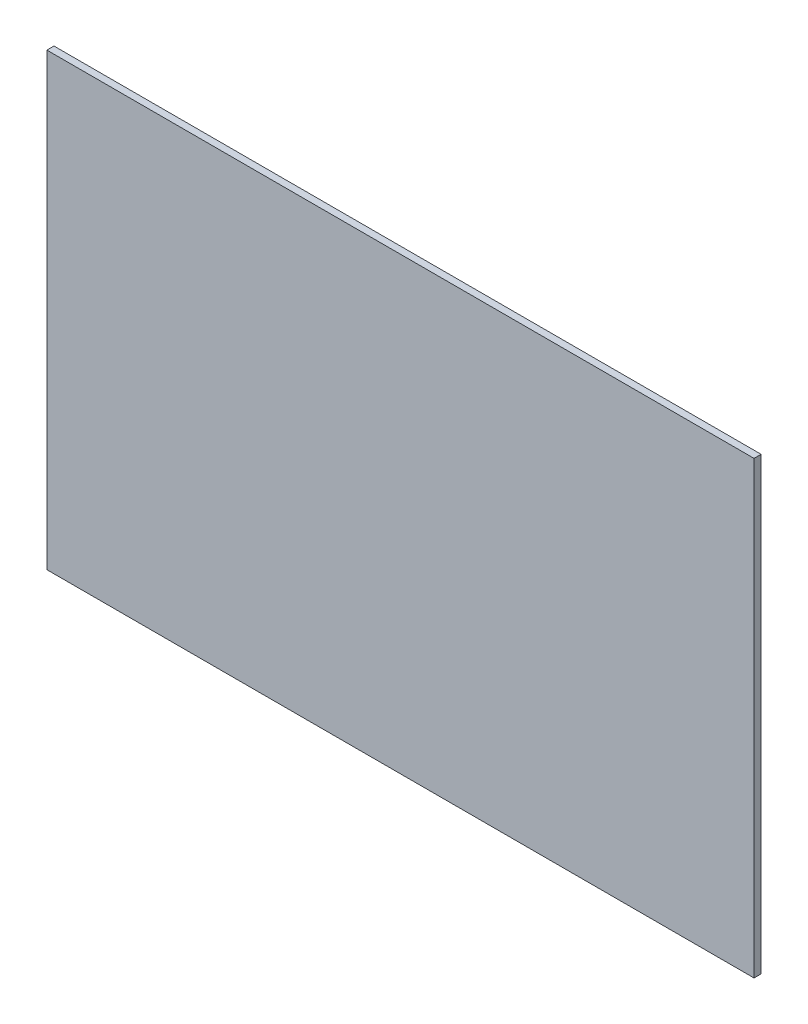
ISO-10303-21;
HEADER;
FILE_DESCRIPTION(('STEP AP214'),'2;1');
FILE_NAME('part.step','',(''),(''),'','','');
FILE_SCHEMA(('AUTOMOTIVE_DESIGN { 1 0 10303 214 1 1 1 1 }'));
ENDSEC;
DATA;
#1=APPLICATION_CONTEXT('core data for automotive mechanical design processes');
#2=APPLICATION_PROTOCOL_DEFINITION('international standard','automotive_design',2000,#1);
#3=PRODUCT_CONTEXT('',#1,'mechanical');
#4=PRODUCT('Part','Part','',(#3));
#5=PRODUCT_RELATED_PRODUCT_CATEGORY('part','',(#4));
#6=PRODUCT_DEFINITION_FORMATION('','',#4);
#7=PRODUCT_DEFINITION_CONTEXT('part definition',#1,'design');
#8=PRODUCT_DEFINITION('design','',#6,#7);
#9=PRODUCT_DEFINITION_SHAPE('','',#8);
#10=(LENGTH_UNIT() NAMED_UNIT(*) SI_UNIT(.MILLI.,.METRE.));
#11=(NAMED_UNIT(*) PLANE_ANGLE_UNIT() SI_UNIT($,.RADIAN.));
#12=(NAMED_UNIT(*) SI_UNIT($,.STERADIAN.) SOLID_ANGLE_UNIT());
#13=UNCERTAINTY_MEASURE_WITH_UNIT(LENGTH_MEASURE(1.E-05),#10,'distance_accuracy_value','');
#14=(GEOMETRIC_REPRESENTATION_CONTEXT(3) GLOBAL_UNCERTAINTY_ASSIGNED_CONTEXT((#13)) GLOBAL_UNIT_ASSIGNED_CONTEXT((#10,
#11,#12)) REPRESENTATION_CONTEXT('',''));
#15=CARTESIAN_POINT('',(0.,0.,0.));
#16=DIRECTION('',(0.,0.,1.));
#17=DIRECTION('',(1.,0.,0.));
#18=AXIS2_PLACEMENT_3D('',#15,#16,#17);
#19=CARTESIAN_POINT('',(139.7,-88.9,2.794));
#20=DIRECTION('',(-1.,0.,0.));
#21=DIRECTION('',(0.,0.,1.));
#22=AXIS2_PLACEMENT_3D('',#19,#20,#21);
#23=PLANE('',#22);
#24=DIRECTION('',(0.,1.,0.));
#25=VECTOR('',#24,1.);
#26=CARTESIAN_POINT('',(139.7,-88.9,0.));
#27=LINE('',#26,#25);
#28=CARTESIAN_POINT('',(139.7,-88.9,0.));
#29=VERTEX_POINT('',#28);
#30=CARTESIAN_POINT('',(139.7,88.9,0.));
#31=VERTEX_POINT('',#30);
#32=EDGE_CURVE('E97',#29,#31,#27,.T.);
#33=ORIENTED_EDGE('',*,*,#32,.T.);
#34=DIRECTION('',(0.,0.,-1.));
#35=VECTOR('',#34,1.);
#36=CARTESIAN_POINT('',(139.7,88.9,2.794));
#37=LINE('',#36,#35);
#38=CARTESIAN_POINT('',(139.7,88.9,2.794));
#39=VERTEX_POINT('',#38);
#40=EDGE_CURVE('E11',#39,#31,#37,.T.);
#41=ORIENTED_EDGE('',*,*,#40,.F.);
#42=DIRECTION('',(0.,1.,0.));
#43=VECTOR('',#42,1.);
#44=CARTESIAN_POINT('',(139.7,-88.9,2.794));
#45=LINE('',#44,#43);
#46=CARTESIAN_POINT('',(139.7,-88.9,2.794));
#47=VERTEX_POINT('',#46);
#48=EDGE_CURVE('E85',#47,#39,#45,.T.);
#49=ORIENTED_EDGE('',*,*,#48,.F.);
#50=DIRECTION('',(0.,0.,-1.));
#51=VECTOR('',#50,1.);
#52=CARTESIAN_POINT('',(139.7,-88.9,2.794));
#53=LINE('',#52,#51);
#54=EDGE_CURVE('E93',#47,#29,#53,.T.);
#55=ORIENTED_EDGE('',*,*,#54,.T.);
#56=EDGE_LOOP('',(#33,#41,#49,#55));
#57=FACE_BOUND('',#56,.T.);
#58=ADVANCED_FACE('F34',(#57),#23,.F.);
#59=CARTESIAN_POINT('',(-139.7,88.9,2.794));
#60=DIRECTION('',(0.,-1.,0.));
#61=DIRECTION('',(0.,0.,-1.));
#62=AXIS2_PLACEMENT_3D('',#59,#60,#61);
#63=PLANE('',#62);
#64=DIRECTION('',(-1.,0.,0.));
#65=VECTOR('',#64,1.);
#66=CARTESIAN_POINT('',(-139.7,88.9,0.));
#67=LINE('',#66,#65);
#68=CARTESIAN_POINT('',(-139.7,88.9,0.));
#69=VERTEX_POINT('',#68);
#70=EDGE_CURVE('E89',#31,#69,#67,.T.);
#71=ORIENTED_EDGE('',*,*,#70,.T.);
#72=DIRECTION('',(0.,0.,-1.));
#73=VECTOR('',#72,1.);
#74=CARTESIAN_POINT('',(-139.7,88.9,2.794));
#75=LINE('',#74,#73);
#76=CARTESIAN_POINT('',(-139.7,88.9,2.794));
#77=VERTEX_POINT('',#76);
#78=EDGE_CURVE('E42',#77,#69,#75,.T.);
#79=ORIENTED_EDGE('',*,*,#78,.F.);
#80=DIRECTION('',(-1.,0.,0.));
#81=VECTOR('',#80,1.);
#82=CARTESIAN_POINT('',(-139.7,88.9,2.794));
#83=LINE('',#82,#81);
#84=EDGE_CURVE('E80',#39,#77,#83,.T.);
#85=ORIENTED_EDGE('',*,*,#84,.F.);
#86=ORIENTED_EDGE('',*,*,#40,.T.);
#87=EDGE_LOOP('',(#71,#79,#85,#86));
#88=FACE_BOUND('',#87,.T.);
#89=ADVANCED_FACE('F88',(#88),#63,.F.);
#90=CARTESIAN_POINT('',(-139.7,-88.9,2.794));
#91=DIRECTION('',(1.,0.,0.));
#92=DIRECTION('',(0.,0.,-1.));
#93=AXIS2_PLACEMENT_3D('',#90,#91,#92);
#94=PLANE('',#93);
#95=DIRECTION('',(0.,-1.,0.));
#96=VECTOR('',#95,1.);
#97=CARTESIAN_POINT('',(-139.7,-88.9,0.));
#98=LINE('',#97,#96);
#99=CARTESIAN_POINT('',(-139.7,-88.9,0.));
#100=VERTEX_POINT('',#99);
#101=EDGE_CURVE('E67',#69,#100,#98,.T.);
#102=ORIENTED_EDGE('',*,*,#101,.T.);
#103=DIRECTION('',(0.,0.,-1.));
#104=VECTOR('',#103,1.);
#105=CARTESIAN_POINT('',(-139.7,-88.9,2.794));
#106=LINE('',#105,#104);
#107=CARTESIAN_POINT('',(-139.7,-88.9,2.794));
#108=VERTEX_POINT('',#107);
#109=EDGE_CURVE('E90',#108,#100,#106,.T.);
#110=ORIENTED_EDGE('',*,*,#109,.F.);
#111=DIRECTION('',(0.,-1.,0.));
#112=VECTOR('',#111,1.);
#113=CARTESIAN_POINT('',(-139.7,-88.9,2.794));
#114=LINE('',#113,#112);
#115=EDGE_CURVE('E83',#77,#108,#114,.T.);
#116=ORIENTED_EDGE('',*,*,#115,.F.);
#117=ORIENTED_EDGE('',*,*,#78,.T.);
#118=EDGE_LOOP('',(#102,#110,#116,#117));
#119=FACE_BOUND('',#118,.T.);
#120=ADVANCED_FACE('F91',(#119),#94,.F.);
#121=CARTESIAN_POINT('',(-139.7,-88.9,2.794));
#122=DIRECTION('',(0.,1.,0.));
#123=DIRECTION('',(0.,0.,1.));
#124=AXIS2_PLACEMENT_3D('',#121,#122,#123);
#125=PLANE('',#124);
#126=DIRECTION('',(1.,0.,0.));
#127=VECTOR('',#126,1.);
#128=CARTESIAN_POINT('',(-139.7,-88.9,0.));
#129=LINE('',#128,#127);
#130=EDGE_CURVE('E73',#100,#29,#129,.T.);
#131=ORIENTED_EDGE('',*,*,#130,.T.);
#132=ORIENTED_EDGE('',*,*,#54,.F.);
#133=DIRECTION('',(1.,0.,0.));
#134=VECTOR('',#133,1.);
#135=CARTESIAN_POINT('',(-139.7,-88.9,2.794));
#136=LINE('',#135,#134);
#137=EDGE_CURVE('E50',#108,#47,#136,.T.);
#138=ORIENTED_EDGE('',*,*,#137,.F.);
#139=ORIENTED_EDGE('',*,*,#109,.T.);
#140=EDGE_LOOP('',(#131,#132,#138,#139));
#141=FACE_BOUND('',#140,.T.);
#142=ADVANCED_FACE('F104',(#141),#125,.F.);
#143=CARTESIAN_POINT('',(0.,0.,2.794));
#144=DIRECTION('',(0.,0.,-1.));
#145=DIRECTION('',(-1.,0.,0.));
#146=AXIS2_PLACEMENT_3D('',#143,#144,#145);
#147=PLANE('',#146);
#148=ORIENTED_EDGE('',*,*,#48,.T.);
#149=ORIENTED_EDGE('',*,*,#84,.T.);
#150=ORIENTED_EDGE('',*,*,#115,.T.);
#151=ORIENTED_EDGE('',*,*,#137,.T.);
#152=EDGE_LOOP('',(#148,#149,#150,#151));
#153=FACE_BOUND('',#152,.T.);
#154=ADVANCED_FACE('F81',(#153),#147,.F.);
#155=CARTESIAN_POINT('',(0.,0.,0.));
#156=DIRECTION('',(0.,0.,-1.));
#157=DIRECTION('',(-1.,0.,0.));
#158=AXIS2_PLACEMENT_3D('',#155,#156,#157);
#159=PLANE('',#158);
#160=ORIENTED_EDGE('',*,*,#32,.F.);
#161=ORIENTED_EDGE('',*,*,#130,.F.);
#162=ORIENTED_EDGE('',*,*,#101,.F.);
#163=ORIENTED_EDGE('',*,*,#70,.F.);
#164=EDGE_LOOP('',(#160,#161,#162,#163));
#165=FACE_BOUND('',#164,.T.);
#166=ADVANCED_FACE('F107',(#165),#159,.T.);
#167=CLOSED_SHELL('',(#58,#89,#120,#142,#154,#166));
#168=MANIFOLD_SOLID_BREP('B2',#167);
#169=ADVANCED_BREP_SHAPE_REPRESENTATION('',(#18,#168),#14);
#170=SHAPE_DEFINITION_REPRESENTATION(#9,#169);
ENDSEC;
END-ISO-10303-21;
